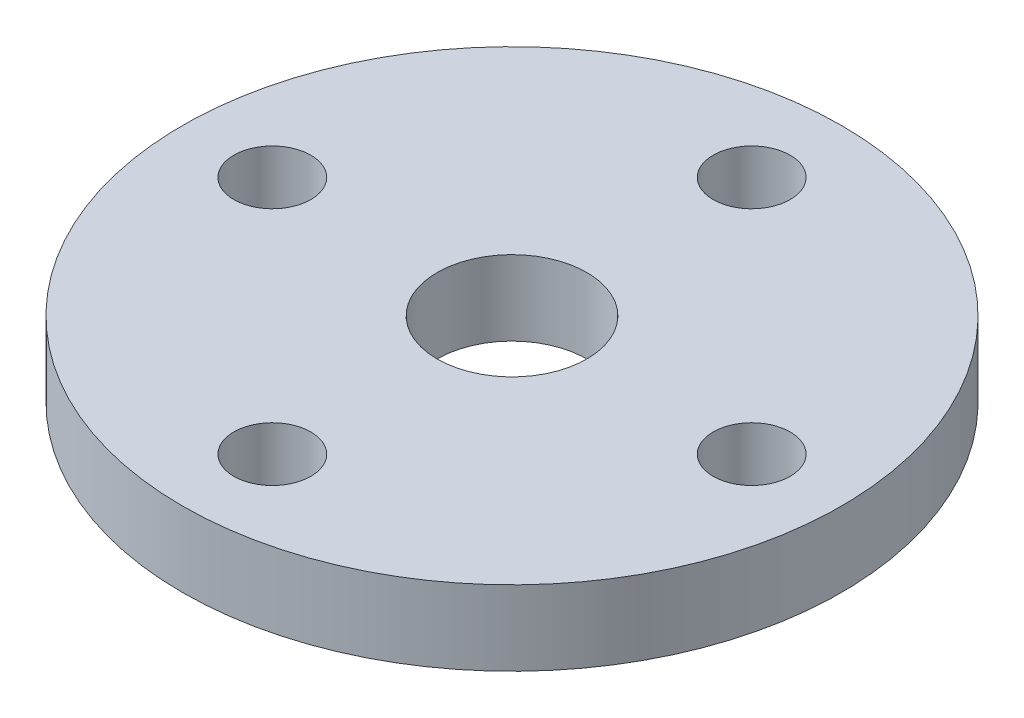
ISO-10303-21;
HEADER;
FILE_DESCRIPTION(('STEP AP214'),'2;1');
FILE_NAME('part.step','',(''),(''),'','','');
FILE_SCHEMA(('AUTOMOTIVE_DESIGN { 1 0 10303 214 1 1 1 1 }'));
ENDSEC;
DATA;
#1=APPLICATION_CONTEXT('core data for automotive mechanical design processes');
#2=APPLICATION_PROTOCOL_DEFINITION('international standard','automotive_design',2000,#1);
#3=PRODUCT_CONTEXT('',#1,'mechanical');
#4=PRODUCT('Part','Part','',(#3));
#5=PRODUCT_RELATED_PRODUCT_CATEGORY('part','',(#4));
#6=PRODUCT_DEFINITION_FORMATION('','',#4);
#7=PRODUCT_DEFINITION_CONTEXT('part definition',#1,'design');
#8=PRODUCT_DEFINITION('design','',#6,#7);
#9=PRODUCT_DEFINITION_SHAPE('','',#8);
#10=(LENGTH_UNIT() NAMED_UNIT(*) SI_UNIT(.MILLI.,.METRE.));
#11=(NAMED_UNIT(*) PLANE_ANGLE_UNIT() SI_UNIT($,.RADIAN.));
#12=(NAMED_UNIT(*) SI_UNIT($,.STERADIAN.) SOLID_ANGLE_UNIT());
#13=UNCERTAINTY_MEASURE_WITH_UNIT(LENGTH_MEASURE(1.E-05),#10,'distance_accuracy_value','');
#14=(GEOMETRIC_REPRESENTATION_CONTEXT(3) GLOBAL_UNCERTAINTY_ASSIGNED_CONTEXT((#13)) GLOBAL_UNIT_ASSIGNED_CONTEXT((#10,
#11,#12)) REPRESENTATION_CONTEXT('',''));
#15=CARTESIAN_POINT('',(0.,0.,0.));
#16=DIRECTION('',(0.,0.,1.));
#17=DIRECTION('',(1.,0.,0.));
#18=AXIS2_PLACEMENT_3D('',#15,#16,#17);
#19=CARTESIAN_POINT('',(0.,3.175,0.));
#20=DIRECTION('',(0.,-1.,0.));
#21=DIRECTION('',(0.,0.,-1.));
#22=AXIS2_PLACEMENT_3D('',#19,#20,#21);
#23=CYLINDRICAL_SURFACE('',#22,13.97);
#24=CARTESIAN_POINT('',(0.,3.175,0.));
#25=DIRECTION('',(0.,1.,0.));
#26=DIRECTION('',(0.,0.,1.));
#27=AXIS2_PLACEMENT_3D('',#24,#25,#26);
#28=CIRCLE('',#27,13.97);
#29=CARTESIAN_POINT('',(0.,3.175,13.97));
#30=VERTEX_POINT('',#29);
#31=EDGE_CURVE('E10',#30,#30,#28,.T.);
#32=ORIENTED_EDGE('',*,*,#31,.F.);
#33=EDGE_LOOP('',(#32));
#34=FACE_BOUND('',#33,.T.);
#35=CARTESIAN_POINT('',(0.,0.,0.));
#36=DIRECTION('',(0.,1.,0.));
#37=DIRECTION('',(0.,0.,1.));
#38=AXIS2_PLACEMENT_3D('',#35,#36,#37);
#39=CIRCLE('',#38,13.97);
#40=CARTESIAN_POINT('',(0.,0.,13.97));
#41=VERTEX_POINT('',#40);
#42=EDGE_CURVE('E33',#41,#41,#39,.T.);
#43=ORIENTED_EDGE('',*,*,#42,.T.);
#44=EDGE_LOOP('',(#43));
#45=FACE_BOUND('',#44,.T.);
#46=ADVANCED_FACE('F30',(#34,#45),#23,.T.);
#47=CARTESIAN_POINT('',(0.,3.175,0.));
#48=DIRECTION('',(0.,1.,0.));
#49=DIRECTION('',(0.,0.,1.));
#50=AXIS2_PLACEMENT_3D('',#47,#48,#49);
#51=PLANE('',#50);
#52=CARTESIAN_POINT('',(10.16,3.175,-1.06420351207939E-13));
#53=DIRECTION('',(0.,1.,0.));
#54=DIRECTION('',(0.,0.,1.));
#55=AXIS2_PLACEMENT_3D('',#52,#53,#54);
#56=CIRCLE('',#55,1.63194999999999);
#57=CARTESIAN_POINT('',(10.16,3.175,1.63194999999988));
#58=VERTEX_POINT('',#57);
#59=EDGE_CURVE('E68',#58,#58,#56,.T.);
#60=ORIENTED_EDGE('',*,*,#59,.F.);
#61=EDGE_LOOP('',(#60));
#62=FACE_BOUND('',#61,.T.);
#63=CARTESIAN_POINT('',(0.,3.175,10.16));
#64=DIRECTION('',(0.,1.,0.));
#65=DIRECTION('',(0.,0.,1.));
#66=AXIS2_PLACEMENT_3D('',#63,#64,#65);
#67=CIRCLE('',#66,1.63194999999999);
#68=CARTESIAN_POINT('',(0.,3.175,11.79195));
#69=VERTEX_POINT('',#68);
#70=EDGE_CURVE('E62',#69,#69,#67,.T.);
#71=ORIENTED_EDGE('',*,*,#70,.F.);
#72=EDGE_LOOP('',(#71));
#73=FACE_BOUND('',#72,.T.);
#74=CARTESIAN_POINT('',(-10.16,3.175,0.));
#75=DIRECTION('',(0.,1.,0.));
#76=DIRECTION('',(0.,0.,1.));
#77=AXIS2_PLACEMENT_3D('',#74,#75,#76);
#78=CIRCLE('',#77,1.63194999999999);
#79=CARTESIAN_POINT('',(-10.16,3.175,1.63195000000003));
#80=VERTEX_POINT('',#79);
#81=EDGE_CURVE('E56',#80,#80,#78,.T.);
#82=ORIENTED_EDGE('',*,*,#81,.F.);
#83=EDGE_LOOP('',(#82));
#84=FACE_BOUND('',#83,.T.);
#85=CARTESIAN_POINT('',(0.,3.175,-10.16));
#86=DIRECTION('',(0.,1.,0.));
#87=DIRECTION('',(0.,0.,1.));
#88=AXIS2_PLACEMENT_3D('',#85,#86,#87);
#89=CIRCLE('',#88,1.63194999999999);
#90=CARTESIAN_POINT('',(0.,3.175,-8.52805000000001));
#91=VERTEX_POINT('',#90);
#92=EDGE_CURVE('E50',#91,#91,#89,.T.);
#93=ORIENTED_EDGE('',*,*,#92,.F.);
#94=EDGE_LOOP('',(#93));
#95=FACE_BOUND('',#94,.T.);
#96=CARTESIAN_POINT('',(0.,3.175,0.));
#97=DIRECTION('',(0.,1.,0.));
#98=DIRECTION('',(0.,0.,1.));
#99=AXIS2_PLACEMENT_3D('',#96,#97,#98);
#100=CIRCLE('',#99,3.175);
#101=CARTESIAN_POINT('',(0.,3.175,3.175));
#102=VERTEX_POINT('',#101);
#103=EDGE_CURVE('E42',#102,#102,#100,.T.);
#104=ORIENTED_EDGE('',*,*,#103,.F.);
#105=EDGE_LOOP('',(#104));
#106=FACE_BOUND('',#105,.T.);
#107=ORIENTED_EDGE('',*,*,#31,.T.);
#108=EDGE_LOOP('',(#107));
#109=FACE_BOUND('',#108,.T.);
#110=ADVANCED_FACE('F75',(#62,#73,#84,#95,#106,#109),#51,.T.);
#111=CARTESIAN_POINT('',(0.,0.,0.));
#112=DIRECTION('',(0.,1.,0.));
#113=DIRECTION('',(0.,0.,1.));
#114=AXIS2_PLACEMENT_3D('',#111,#112,#113);
#115=PLANE('',#114);
#116=CARTESIAN_POINT('',(10.16,0.,-1.06420351207939E-13));
#117=DIRECTION('',(0.,1.,0.));
#118=DIRECTION('',(0.,0.,1.));
#119=AXIS2_PLACEMENT_3D('',#116,#117,#118);
#120=CIRCLE('',#119,1.63194999999999);
#121=CARTESIAN_POINT('',(10.16,0.,1.63194999999988));
#122=VERTEX_POINT('',#121);
#123=EDGE_CURVE('E65',#122,#122,#120,.T.);
#124=ORIENTED_EDGE('',*,*,#123,.T.);
#125=EDGE_LOOP('',(#124));
#126=FACE_BOUND('',#125,.T.);
#127=CARTESIAN_POINT('',(0.,0.,10.16));
#128=DIRECTION('',(0.,1.,0.));
#129=DIRECTION('',(0.,0.,1.));
#130=AXIS2_PLACEMENT_3D('',#127,#128,#129);
#131=CIRCLE('',#130,1.63194999999999);
#132=CARTESIAN_POINT('',(0.,0.,11.79195));
#133=VERTEX_POINT('',#132);
#134=EDGE_CURVE('E59',#133,#133,#131,.T.);
#135=ORIENTED_EDGE('',*,*,#134,.T.);
#136=EDGE_LOOP('',(#135));
#137=FACE_BOUND('',#136,.T.);
#138=CARTESIAN_POINT('',(-10.16,0.,0.));
#139=DIRECTION('',(0.,1.,0.));
#140=DIRECTION('',(0.,0.,1.));
#141=AXIS2_PLACEMENT_3D('',#138,#139,#140);
#142=CIRCLE('',#141,1.63194999999999);
#143=CARTESIAN_POINT('',(-10.16,0.,1.63195000000002));
#144=VERTEX_POINT('',#143);
#145=EDGE_CURVE('E53',#144,#144,#142,.T.);
#146=ORIENTED_EDGE('',*,*,#145,.T.);
#147=EDGE_LOOP('',(#146));
#148=FACE_BOUND('',#147,.T.);
#149=CARTESIAN_POINT('',(0.,0.,-10.16));
#150=DIRECTION('',(0.,1.,0.));
#151=DIRECTION('',(0.,0.,1.));
#152=AXIS2_PLACEMENT_3D('',#149,#150,#151);
#153=CIRCLE('',#152,1.63194999999999);
#154=CARTESIAN_POINT('',(0.,0.,-8.52805000000001));
#155=VERTEX_POINT('',#154);
#156=EDGE_CURVE('E45',#155,#155,#153,.T.);
#157=ORIENTED_EDGE('',*,*,#156,.T.);
#158=EDGE_LOOP('',(#157));
#159=FACE_BOUND('',#158,.T.);
#160=CARTESIAN_POINT('',(0.,0.,0.));
#161=DIRECTION('',(0.,1.,0.));
#162=DIRECTION('',(0.,0.,1.));
#163=AXIS2_PLACEMENT_3D('',#160,#161,#162);
#164=CIRCLE('',#163,3.175);
#165=CARTESIAN_POINT('',(0.,0.,3.175));
#166=VERTEX_POINT('',#165);
#167=EDGE_CURVE('E40',#166,#166,#164,.T.);
#168=ORIENTED_EDGE('',*,*,#167,.T.);
#169=EDGE_LOOP('',(#168));
#170=FACE_BOUND('',#169,.T.);
#171=ORIENTED_EDGE('',*,*,#42,.F.);
#172=EDGE_LOOP('',(#171));
#173=FACE_BOUND('',#172,.T.);
#174=ADVANCED_FACE('F78',(#126,#137,#148,#159,#170,#173),#115,.F.);
#175=CARTESIAN_POINT('',(0.,0.,0.));
#176=DIRECTION('',(0.,1.,0.));
#177=DIRECTION('',(0.,0.,1.));
#178=AXIS2_PLACEMENT_3D('',#175,#176,#177);
#179=CYLINDRICAL_SURFACE('',#178,3.175);
#180=ORIENTED_EDGE('',*,*,#167,.F.);
#181=EDGE_LOOP('',(#180));
#182=FACE_BOUND('',#181,.T.);
#183=ORIENTED_EDGE('',*,*,#103,.T.);
#184=EDGE_LOOP('',(#183));
#185=FACE_BOUND('',#184,.T.);
#186=ADVANCED_FACE('F88',(#182,#185),#179,.F.);
#187=CARTESIAN_POINT('',(0.,3.175,-10.16));
#188=DIRECTION('',(0.,1.,0.));
#189=DIRECTION('',(0.,0.,1.));
#190=AXIS2_PLACEMENT_3D('',#187,#188,#189);
#191=CYLINDRICAL_SURFACE('',#190,1.63194999999999);
#192=ORIENTED_EDGE('',*,*,#92,.T.);
#193=EDGE_LOOP('',(#192));
#194=FACE_BOUND('',#193,.T.);
#195=ORIENTED_EDGE('',*,*,#156,.F.);
#196=EDGE_LOOP('',(#195));
#197=FACE_BOUND('',#196,.T.);
#198=ADVANCED_FACE('F90',(#194,#197),#191,.F.);
#199=CARTESIAN_POINT('',(-10.16,3.175,0.));
#200=DIRECTION('',(0.,1.,0.));
#201=DIRECTION('',(0.,0.,1.));
#202=AXIS2_PLACEMENT_3D('',#199,#200,#201);
#203=CYLINDRICAL_SURFACE('',#202,1.63194999999999);
#204=ORIENTED_EDGE('',*,*,#81,.T.);
#205=EDGE_LOOP('',(#204));
#206=FACE_BOUND('',#205,.T.);
#207=ORIENTED_EDGE('',*,*,#145,.F.);
#208=EDGE_LOOP('',(#207));
#209=FACE_BOUND('',#208,.T.);
#210=ADVANCED_FACE('F97',(#206,#209),#203,.F.);
#211=CARTESIAN_POINT('',(0.,3.175,10.16));
#212=DIRECTION('',(0.,1.,0.));
#213=DIRECTION('',(0.,0.,1.));
#214=AXIS2_PLACEMENT_3D('',#211,#212,#213);
#215=CYLINDRICAL_SURFACE('',#214,1.63194999999999);
#216=ORIENTED_EDGE('',*,*,#70,.T.);
#217=EDGE_LOOP('',(#216));
#218=FACE_BOUND('',#217,.T.);
#219=ORIENTED_EDGE('',*,*,#134,.F.);
#220=EDGE_LOOP('',(#219));
#221=FACE_BOUND('',#220,.T.);
#222=ADVANCED_FACE('F128',(#218,#221),#215,.F.);
#223=CARTESIAN_POINT('',(10.16,3.175,-1.06420351207939E-13));
#224=DIRECTION('',(0.,1.,0.));
#225=DIRECTION('',(0.,0.,1.));
#226=AXIS2_PLACEMENT_3D('',#223,#224,#225);
#227=CYLINDRICAL_SURFACE('',#226,1.63194999999999);
#228=ORIENTED_EDGE('',*,*,#59,.T.);
#229=EDGE_LOOP('',(#228));
#230=FACE_BOUND('',#229,.T.);
#231=ORIENTED_EDGE('',*,*,#123,.F.);
#232=EDGE_LOOP('',(#231));
#233=FACE_BOUND('',#232,.T.);
#234=ADVANCED_FACE('F72',(#230,#233),#227,.F.);
#235=CLOSED_SHELL('',(#46,#110,#174,#186,#198,#210,#222,#234));
#236=MANIFOLD_SOLID_BREP('B2',#235);
#237=ADVANCED_BREP_SHAPE_REPRESENTATION('',(#18,#236),#14);
#238=SHAPE_DEFINITION_REPRESENTATION(#9,#237);
ENDSEC;
END-ISO-10303-21;
